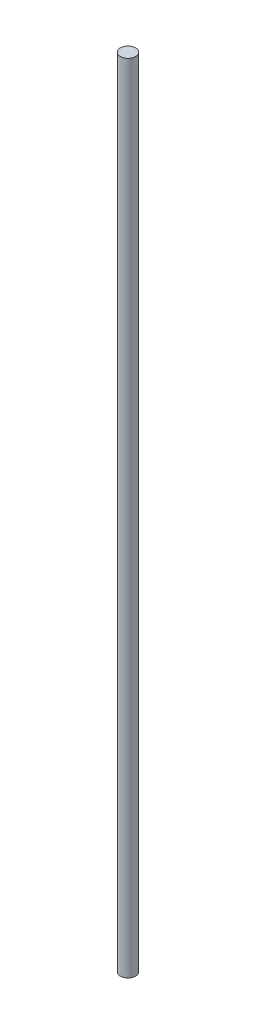
ISO-10303-21;
HEADER;
FILE_DESCRIPTION(('STEP AP214'),'2;1');
FILE_NAME('part.step','',(''),(''),'','','');
FILE_SCHEMA(('AUTOMOTIVE_DESIGN { 1 0 10303 214 1 1 1 1 }'));
ENDSEC;
DATA;
#1=APPLICATION_CONTEXT('core data for automotive mechanical design processes');
#2=APPLICATION_PROTOCOL_DEFINITION('international standard','automotive_design',2000,#1);
#3=PRODUCT_CONTEXT('',#1,'mechanical');
#4=PRODUCT('Part','Part','',(#3));
#5=PRODUCT_RELATED_PRODUCT_CATEGORY('part','',(#4));
#6=PRODUCT_DEFINITION_FORMATION('','',#4);
#7=PRODUCT_DEFINITION_CONTEXT('part definition',#1,'design');
#8=PRODUCT_DEFINITION('design','',#6,#7);
#9=PRODUCT_DEFINITION_SHAPE('','',#8);
#10=(LENGTH_UNIT() NAMED_UNIT(*) SI_UNIT(.MILLI.,.METRE.));
#11=(NAMED_UNIT(*) PLANE_ANGLE_UNIT() SI_UNIT($,.RADIAN.));
#12=(NAMED_UNIT(*) SI_UNIT($,.STERADIAN.) SOLID_ANGLE_UNIT());
#13=UNCERTAINTY_MEASURE_WITH_UNIT(LENGTH_MEASURE(1.E-05),#10,'distance_accuracy_value','');
#14=(GEOMETRIC_REPRESENTATION_CONTEXT(3) GLOBAL_UNCERTAINTY_ASSIGNED_CONTEXT((#13)) GLOBAL_UNIT_ASSIGNED_CONTEXT((#10,
#11,#12)) REPRESENTATION_CONTEXT('',''));
#15=CARTESIAN_POINT('',(0.,0.,0.));
#16=DIRECTION('',(0.,0.,1.));
#17=DIRECTION('',(1.,0.,0.));
#18=AXIS2_PLACEMENT_3D('',#15,#16,#17);
#19=CARTESIAN_POINT('',(0.,420.,0.));
#20=DIRECTION('',(0.,-1.,0.));
#21=DIRECTION('',(0.,0.,-1.));
#22=AXIS2_PLACEMENT_3D('',#19,#20,#21);
#23=CYLINDRICAL_SURFACE('',#22,4.);
#24=CARTESIAN_POINT('',(0.,420.,0.));
#25=DIRECTION('',(0.,1.,0.));
#26=DIRECTION('',(0.,0.,1.));
#27=AXIS2_PLACEMENT_3D('',#24,#25,#26);
#28=CIRCLE('',#27,4.);
#29=CARTESIAN_POINT('',(0.,420.,4.));
#30=VERTEX_POINT('',#29);
#31=EDGE_CURVE('E10',#30,#30,#28,.T.);
#32=ORIENTED_EDGE('',*,*,#31,.F.);
#33=EDGE_LOOP('',(#32));
#34=FACE_BOUND('',#33,.T.);
#35=CARTESIAN_POINT('',(0.,0.,0.));
#36=DIRECTION('',(0.,1.,0.));
#37=DIRECTION('',(0.,0.,1.));
#38=AXIS2_PLACEMENT_3D('',#35,#36,#37);
#39=CIRCLE('',#38,4.);
#40=CARTESIAN_POINT('',(0.,0.,4.));
#41=VERTEX_POINT('',#40);
#42=EDGE_CURVE('E33',#41,#41,#39,.T.);
#43=ORIENTED_EDGE('',*,*,#42,.T.);
#44=EDGE_LOOP('',(#43));
#45=FACE_BOUND('',#44,.T.);
#46=ADVANCED_FACE('F30',(#34,#45),#23,.T.);
#47=CARTESIAN_POINT('',(0.,420.,0.));
#48=DIRECTION('',(0.,1.,0.));
#49=DIRECTION('',(0.,0.,1.));
#50=AXIS2_PLACEMENT_3D('',#47,#48,#49);
#51=PLANE('',#50);
#52=ORIENTED_EDGE('',*,*,#31,.T.);
#53=EDGE_LOOP('',(#52));
#54=FACE_BOUND('',#53,.T.);
#55=ADVANCED_FACE('F45',(#54),#51,.T.);
#56=CARTESIAN_POINT('',(0.,0.,0.));
#57=DIRECTION('',(0.,1.,0.));
#58=DIRECTION('',(0.,0.,1.));
#59=AXIS2_PLACEMENT_3D('',#56,#57,#58);
#60=PLANE('',#59);
#61=ORIENTED_EDGE('',*,*,#42,.F.);
#62=EDGE_LOOP('',(#61));
#63=FACE_BOUND('',#62,.T.);
#64=ADVANCED_FACE('F43',(#63),#60,.F.);
#65=CLOSED_SHELL('',(#46,#55,#64));
#66=MANIFOLD_SOLID_BREP('B2',#65);
#67=ADVANCED_BREP_SHAPE_REPRESENTATION('',(#18,#66),#14);
#68=SHAPE_DEFINITION_REPRESENTATION(#9,#67);
ENDSEC;
END-ISO-10303-21;
